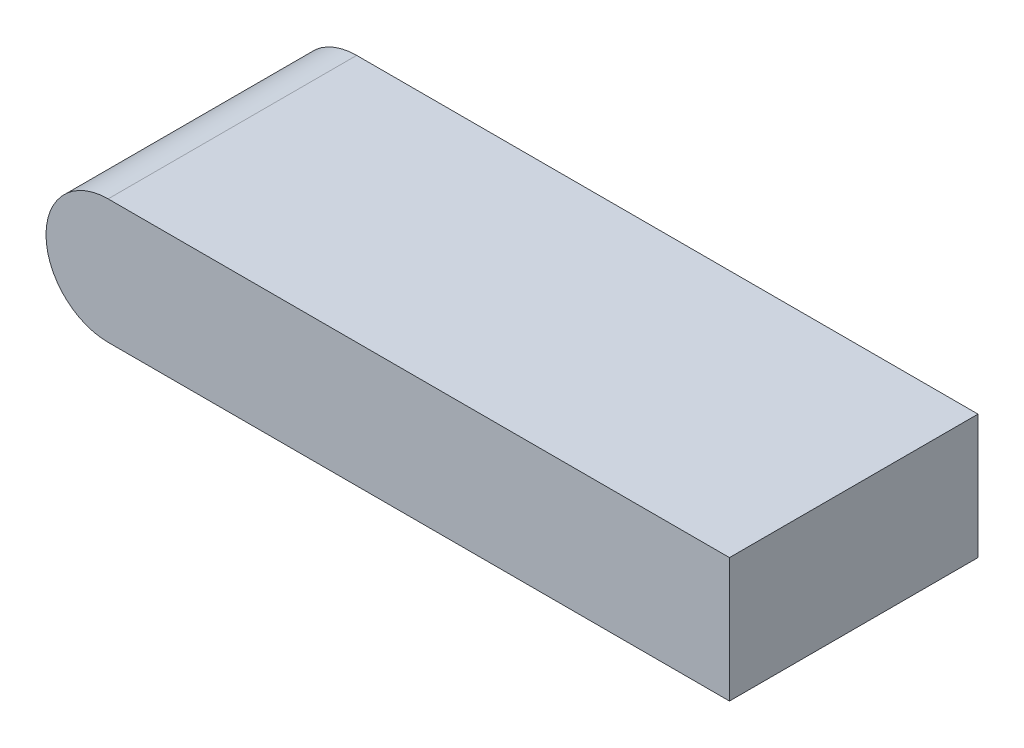
ISO-10303-21;
HEADER;
FILE_DESCRIPTION(('STEP AP214'),'2;1');
FILE_NAME('part.step','',(''),(''),'','','');
FILE_SCHEMA(('AUTOMOTIVE_DESIGN { 1 0 10303 214 1 1 1 1 }'));
ENDSEC;
DATA;
#1=APPLICATION_CONTEXT('core data for automotive mechanical design processes');
#2=APPLICATION_PROTOCOL_DEFINITION('international standard','automotive_design',2000,#1);
#3=PRODUCT_CONTEXT('',#1,'mechanical');
#4=PRODUCT('Part','Part','',(#3));
#5=PRODUCT_RELATED_PRODUCT_CATEGORY('part','',(#4));
#6=PRODUCT_DEFINITION_FORMATION('','',#4);
#7=PRODUCT_DEFINITION_CONTEXT('part definition',#1,'design');
#8=PRODUCT_DEFINITION('design','',#6,#7);
#9=PRODUCT_DEFINITION_SHAPE('','',#8);
#10=(LENGTH_UNIT() NAMED_UNIT(*) SI_UNIT(.MILLI.,.METRE.));
#11=(NAMED_UNIT(*) PLANE_ANGLE_UNIT() SI_UNIT($,.RADIAN.));
#12=(NAMED_UNIT(*) SI_UNIT($,.STERADIAN.) SOLID_ANGLE_UNIT());
#13=UNCERTAINTY_MEASURE_WITH_UNIT(LENGTH_MEASURE(1.E-05),#10,'distance_accuracy_value','');
#14=(GEOMETRIC_REPRESENTATION_CONTEXT(3) GLOBAL_UNCERTAINTY_ASSIGNED_CONTEXT((#13)) GLOBAL_UNIT_ASSIGNED_CONTEXT((#10,
#11,#12)) REPRESENTATION_CONTEXT('',''));
#15=CARTESIAN_POINT('',(0.,0.,0.));
#16=DIRECTION('',(0.,0.,1.));
#17=DIRECTION('',(1.,0.,0.));
#18=AXIS2_PLACEMENT_3D('',#15,#16,#17);
#19=CARTESIAN_POINT('',(-12.,4.,4.));
#20=DIRECTION('',(0.,0.,-1.));
#21=DIRECTION('',(-1.,0.,0.));
#22=AXIS2_PLACEMENT_3D('',#19,#20,#21);
#23=PLANE('',#22);
#24=DIRECTION('',(1.,0.,0.));
#25=VECTOR('',#24,1.);
#26=CARTESIAN_POINT('',(-12.,4.,4.));
#27=LINE('',#26,#25);
#28=CARTESIAN_POINT('',(-12.,4.,4.));
#29=VERTEX_POINT('',#28);
#30=CARTESIAN_POINT('',(8.,4.,4.));
#31=VERTEX_POINT('',#30);
#32=EDGE_CURVE('E79',#29,#31,#27,.T.);
#33=ORIENTED_EDGE('',*,*,#32,.F.);
#34=CARTESIAN_POINT('',(-12.,2.,4.));
#35=DIRECTION('',(0.,0.,1.));
#36=DIRECTION('',(1.,0.,0.));
#37=AXIS2_PLACEMENT_3D('',#34,#35,#36);
#38=CIRCLE('',#37,2.);
#39=CARTESIAN_POINT('',(-12.,0.,4.));
#40=VERTEX_POINT('',#39);
#41=EDGE_CURVE('E92',#29,#40,#38,.T.);
#42=ORIENTED_EDGE('',*,*,#41,.T.);
#43=DIRECTION('',(1.,0.,0.));
#44=VECTOR('',#43,1.);
#45=CARTESIAN_POINT('',(-12.,0.,4.));
#46=LINE('',#45,#44);
#47=CARTESIAN_POINT('',(8.,0.,4.));
#48=VERTEX_POINT('',#47);
#49=EDGE_CURVE('E83',#40,#48,#46,.T.);
#50=ORIENTED_EDGE('',*,*,#49,.T.);
#51=DIRECTION('',(0.,-1.,0.));
#52=VECTOR('',#51,1.);
#53=CARTESIAN_POINT('',(8.,4.,4.));
#54=LINE('',#53,#52);
#55=EDGE_CURVE('E11',#31,#48,#54,.T.);
#56=ORIENTED_EDGE('',*,*,#55,.F.);
#57=EDGE_LOOP('',(#33,#42,#50,#56));
#58=FACE_BOUND('',#57,.T.);
#59=ADVANCED_FACE('F34',(#58),#23,.F.);
#60=CARTESIAN_POINT('',(8.,4.,-4.));
#61=DIRECTION('',(-1.,0.,0.));
#62=DIRECTION('',(0.,0.,1.));
#63=AXIS2_PLACEMENT_3D('',#60,#61,#62);
#64=PLANE('',#63);
#65=DIRECTION('',(0.,0.,-1.));
#66=VECTOR('',#65,1.);
#67=CARTESIAN_POINT('',(8.,0.,-4.));
#68=LINE('',#67,#66);
#69=CARTESIAN_POINT('',(8.,0.,-4.));
#70=VERTEX_POINT('',#69);
#71=EDGE_CURVE('E64',#48,#70,#68,.T.);
#72=ORIENTED_EDGE('',*,*,#71,.T.);
#73=DIRECTION('',(0.,-1.,0.));
#74=VECTOR('',#73,1.);
#75=CARTESIAN_POINT('',(8.,4.,-4.));
#76=LINE('',#75,#74);
#77=CARTESIAN_POINT('',(8.,4.,-4.));
#78=VERTEX_POINT('',#77);
#79=EDGE_CURVE('E42',#78,#70,#76,.T.);
#80=ORIENTED_EDGE('',*,*,#79,.F.);
#81=DIRECTION('',(0.,0.,-1.));
#82=VECTOR('',#81,1.);
#83=CARTESIAN_POINT('',(8.,4.,-4.));
#84=LINE('',#83,#82);
#85=EDGE_CURVE('E101',#31,#78,#84,.T.);
#86=ORIENTED_EDGE('',*,*,#85,.F.);
#87=ORIENTED_EDGE('',*,*,#55,.T.);
#88=EDGE_LOOP('',(#72,#80,#86,#87));
#89=FACE_BOUND('',#88,.T.);
#90=ADVANCED_FACE('F107',(#89),#64,.F.);
#91=CARTESIAN_POINT('',(-12.,4.,-4.));
#92=DIRECTION('',(0.,0.,1.));
#93=DIRECTION('',(1.,0.,0.));
#94=AXIS2_PLACEMENT_3D('',#91,#92,#93);
#95=PLANE('',#94);
#96=DIRECTION('',(-1.,0.,0.));
#97=VECTOR('',#96,1.);
#98=CARTESIAN_POINT('',(-12.,0.,-4.));
#99=LINE('',#98,#97);
#100=CARTESIAN_POINT('',(-12.,0.,-4.));
#101=VERTEX_POINT('',#100);
#102=EDGE_CURVE('E71',#70,#101,#99,.T.);
#103=ORIENTED_EDGE('',*,*,#102,.T.);
#104=CARTESIAN_POINT('',(-12.,2.,-4.));
#105=DIRECTION('',(0.,0.,1.));
#106=DIRECTION('',(1.,0.,0.));
#107=AXIS2_PLACEMENT_3D('',#104,#105,#106);
#108=CIRCLE('',#107,2.);
#109=CARTESIAN_POINT('',(-12.,4.,-4.));
#110=VERTEX_POINT('',#109);
#111=EDGE_CURVE('E93',#110,#101,#108,.T.);
#112=ORIENTED_EDGE('',*,*,#111,.F.);
#113=DIRECTION('',(-1.,0.,0.));
#114=VECTOR('',#113,1.);
#115=CARTESIAN_POINT('',(-12.,4.,-4.));
#116=LINE('',#115,#114);
#117=EDGE_CURVE('E50',#78,#110,#116,.T.);
#118=ORIENTED_EDGE('',*,*,#117,.F.);
#119=ORIENTED_EDGE('',*,*,#79,.T.);
#120=EDGE_LOOP('',(#103,#112,#118,#119));
#121=FACE_BOUND('',#120,.T.);
#122=ADVANCED_FACE('F105',(#121),#95,.F.);
#123=CARTESIAN_POINT('',(0.,4.,0.));
#124=DIRECTION('',(0.,1.,0.));
#125=DIRECTION('',(0.,0.,1.));
#126=AXIS2_PLACEMENT_3D('',#123,#124,#125);
#127=PLANE('',#126);
#128=DIRECTION('',(0.,0.,1.));
#129=VECTOR('',#128,1.);
#130=CARTESIAN_POINT('',(-12.,4.,-4.));
#131=LINE('',#130,#129);
#132=EDGE_CURVE('E98',#110,#29,#131,.T.);
#133=ORIENTED_EDGE('',*,*,#132,.T.);
#134=ORIENTED_EDGE('',*,*,#32,.T.);
#135=ORIENTED_EDGE('',*,*,#85,.T.);
#136=ORIENTED_EDGE('',*,*,#117,.T.);
#137=EDGE_LOOP('',(#133,#134,#135,#136));
#138=FACE_BOUND('',#137,.T.);
#139=ADVANCED_FACE('F108',(#138),#127,.T.);
#140=CARTESIAN_POINT('',(0.,0.,0.));
#141=DIRECTION('',(0.,1.,0.));
#142=DIRECTION('',(0.,0.,1.));
#143=AXIS2_PLACEMENT_3D('',#140,#141,#142);
#144=PLANE('',#143);
#145=DIRECTION('',(0.,0.,1.));
#146=VECTOR('',#145,1.);
#147=CARTESIAN_POINT('',(-12.,0.,-4.));
#148=LINE('',#147,#146);
#149=EDGE_CURVE('E86',#101,#40,#148,.T.);
#150=ORIENTED_EDGE('',*,*,#149,.F.);
#151=ORIENTED_EDGE('',*,*,#102,.F.);
#152=ORIENTED_EDGE('',*,*,#71,.F.);
#153=ORIENTED_EDGE('',*,*,#49,.F.);
#154=EDGE_LOOP('',(#150,#151,#152,#153));
#155=FACE_BOUND('',#154,.T.);
#156=ADVANCED_FACE('F85',(#155),#144,.F.);
#157=CARTESIAN_POINT('',(-12.,2.,-4.));
#158=DIRECTION('',(0.,0.,1.));
#159=DIRECTION('',(1.,0.,0.));
#160=AXIS2_PLACEMENT_3D('',#157,#158,#159);
#161=CYLINDRICAL_SURFACE('',#160,2.);
#162=ORIENTED_EDGE('',*,*,#132,.F.);
#163=ORIENTED_EDGE('',*,*,#111,.T.);
#164=ORIENTED_EDGE('',*,*,#149,.T.);
#165=ORIENTED_EDGE('',*,*,#41,.F.);
#166=EDGE_LOOP('',(#162,#163,#164,#165));
#167=FACE_BOUND('',#166,.T.);
#168=ADVANCED_FACE('F91',(#167),#161,.T.);
#169=CLOSED_SHELL('',(#59,#90,#122,#139,#156,#168));
#170=MANIFOLD_SOLID_BREP('B2',#169);
#171=ADVANCED_BREP_SHAPE_REPRESENTATION('',(#18,#170),#14);
#172=SHAPE_DEFINITION_REPRESENTATION(#9,#171);
ENDSEC;
END-ISO-10303-21;
